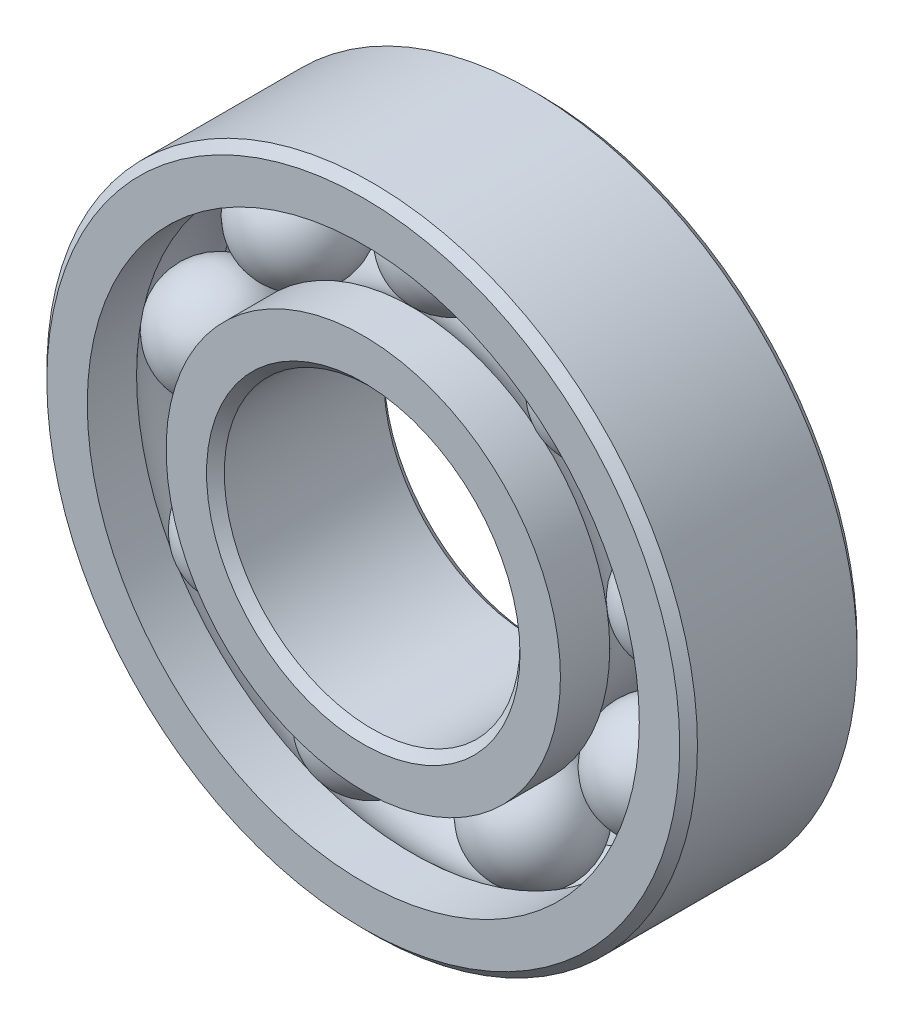
ISO-10303-21;
HEADER;
FILE_DESCRIPTION(('STEP AP214'),'2;1');
FILE_NAME('part.step','',(''),(''),'','','');
FILE_SCHEMA(('AUTOMOTIVE_DESIGN { 1 0 10303 214 1 1 1 1 }'));
ENDSEC;
DATA;
#1=APPLICATION_CONTEXT('core data for automotive mechanical design processes');
#2=APPLICATION_PROTOCOL_DEFINITION('international standard','automotive_design',2000,#1);
#3=PRODUCT_CONTEXT('',#1,'mechanical');
#4=PRODUCT('Part','Part','',(#3));
#5=PRODUCT_RELATED_PRODUCT_CATEGORY('part','',(#4));
#6=PRODUCT_DEFINITION_FORMATION('','',#4);
#7=PRODUCT_DEFINITION_CONTEXT('part definition',#1,'design');
#8=PRODUCT_DEFINITION('design','',#6,#7);
#9=PRODUCT_DEFINITION_SHAPE('','',#8);
#10=(LENGTH_UNIT() NAMED_UNIT(*) SI_UNIT(.MILLI.,.METRE.));
#11=(NAMED_UNIT(*) PLANE_ANGLE_UNIT() SI_UNIT($,.RADIAN.));
#12=(NAMED_UNIT(*) SI_UNIT($,.STERADIAN.) SOLID_ANGLE_UNIT());
#13=UNCERTAINTY_MEASURE_WITH_UNIT(LENGTH_MEASURE(1.E-05),#10,'distance_accuracy_value','');
#14=(GEOMETRIC_REPRESENTATION_CONTEXT(3) GLOBAL_UNCERTAINTY_ASSIGNED_CONTEXT((#13)) GLOBAL_UNIT_ASSIGNED_CONTEXT((#10,
#11,#12)) REPRESENTATION_CONTEXT('',''));
#15=CARTESIAN_POINT('',(0.,0.,0.));
#16=DIRECTION('',(0.,0.,1.));
#17=DIRECTION('',(1.,0.,0.));
#18=AXIS2_PLACEMENT_3D('',#15,#16,#17);
#19=CARTESIAN_POINT('',(5.14230087749224,6.12835554495189,0.));
#20=DIRECTION('',(0.,0.,1.));
#21=DIRECTION('',(0.64278760968653,0.766044443118986,0.));
#22=AXIS2_PLACEMENT_3D('',#19,#20,#21);
#23=SPHERICAL_SURFACE('',#22,1.88561808316413);
#24=CARTESIAN_POINT('',(5.14230087749224,6.12835554495189,1.88561808316413));
#25=VERTEX_POINT('',#24);
#26=VERTEX_LOOP('',#25);
#27=FACE_BOUND('',#26,.T.);
#28=ADVANCED_FACE('F41',(#27),#23,.T.);
#29=CLOSED_SHELL('',(#28));
#30=MANIFOLD_SOLID_BREP('B2',#29);
#31=CARTESIAN_POINT('',(7.87846202409765,1.38918542133552,0.));
#32=DIRECTION('',(0.,0.,1.));
#33=DIRECTION('',(0.984807753012206,0.17364817766694,0.));
#34=AXIS2_PLACEMENT_3D('',#31,#32,#33);
#35=SPHERICAL_SURFACE('',#34,1.88561808316413);
#36=CARTESIAN_POINT('',(7.87846202409765,1.38918542133552,1.88561808316413));
#37=VERTEX_POINT('',#36);
#38=VERTEX_LOOP('',#37);
#39=FACE_BOUND('',#38,.T.);
#40=ADVANCED_FACE('F61',(#39),#35,.T.);
#41=CLOSED_SHELL('',(#40));
#42=MANIFOLD_SOLID_BREP('B6',#41);
#43=CARTESIAN_POINT('',(6.92820323027555,-3.99999999999994,0.));
#44=DIRECTION('',(0.,0.,1.));
#45=DIRECTION('',(0.866025403784443,-0.499999999999992,0.));
#46=AXIS2_PLACEMENT_3D('',#43,#44,#45);
#47=SPHERICAL_SURFACE('',#46,1.88561808316413);
#48=CARTESIAN_POINT('',(6.92820323027555,-3.99999999999994,1.88561808316413));
#49=VERTEX_POINT('',#48);
#50=VERTEX_LOOP('',#49);
#51=FACE_BOUND('',#50,.T.);
#52=ADVANCED_FACE('F81',(#51),#47,.T.);
#53=CLOSED_SHELL('',(#52));
#54=MANIFOLD_SOLID_BREP('B37',#53);
#55=CARTESIAN_POINT('',(2.73616114660541,-7.51754096628725,0.));
#56=DIRECTION('',(0.,0.,1.));
#57=DIRECTION('',(0.342020143325676,-0.939692620785906,0.));
#58=AXIS2_PLACEMENT_3D('',#55,#56,#57);
#59=SPHERICAL_SURFACE('',#58,1.88561808316413);
#60=CARTESIAN_POINT('',(2.73616114660541,-7.51754096628725,1.88561808316413));
#61=VERTEX_POINT('',#60);
#62=VERTEX_LOOP('',#61);
#63=FACE_BOUND('',#62,.T.);
#64=ADVANCED_FACE('F101',(#63),#59,.T.);
#65=CLOSED_SHELL('',(#64));
#66=MANIFOLD_SOLID_BREP('B57',#65);
#67=CARTESIAN_POINT('',(-2.7361611466053,-7.51754096628729,0.));
#68=DIRECTION('',(0.,0.,1.));
#69=DIRECTION('',(-0.342020143325663,-0.939692620785911,0.));
#70=AXIS2_PLACEMENT_3D('',#67,#68,#69);
#71=SPHERICAL_SURFACE('',#70,1.88561808316413);
#72=CARTESIAN_POINT('',(-2.7361611466053,-7.51754096628729,1.88561808316413));
#73=VERTEX_POINT('',#72);
#74=VERTEX_LOOP('',#73);
#75=FACE_BOUND('',#74,.T.);
#76=ADVANCED_FACE('F121',(#75),#71,.T.);
#77=CLOSED_SHELL('',(#76));
#78=MANIFOLD_SOLID_BREP('B77',#77);
#79=CARTESIAN_POINT('',(-6.92820323027549,-4.00000000000003,0.));
#80=DIRECTION('',(0.,0.,1.));
#81=DIRECTION('',(-0.866025403784436,-0.500000000000004,0.));
#82=AXIS2_PLACEMENT_3D('',#79,#80,#81);
#83=SPHERICAL_SURFACE('',#82,1.88561808316413);
#84=CARTESIAN_POINT('',(-6.92820323027549,-4.00000000000003,1.88561808316413));
#85=VERTEX_POINT('',#84);
#86=VERTEX_LOOP('',#85);
#87=FACE_BOUND('',#86,.T.);
#88=ADVANCED_FACE('F141',(#87),#83,.T.);
#89=CLOSED_SHELL('',(#88));
#90=MANIFOLD_SOLID_BREP('B97',#89);
#91=CARTESIAN_POINT('',(-7.87846202409767,1.38918542133542,0.));
#92=DIRECTION('',(0.,0.,1.));
#93=DIRECTION('',(-0.984807753012209,0.173648177666927,0.));
#94=AXIS2_PLACEMENT_3D('',#91,#92,#93);
#95=SPHERICAL_SURFACE('',#94,1.88561808316413);
#96=CARTESIAN_POINT('',(-7.87846202409767,1.38918542133542,1.88561808316413));
#97=VERTEX_POINT('',#96);
#98=VERTEX_LOOP('',#97);
#99=FACE_BOUND('',#98,.T.);
#100=ADVANCED_FACE('F161',(#99),#95,.T.);
#101=CLOSED_SHELL('',(#100));
#102=MANIFOLD_SOLID_BREP('B117',#101);
#103=CARTESIAN_POINT('',(-5.14230087749233,6.12835554495182,0.));
#104=DIRECTION('',(0.,0.,1.));
#105=DIRECTION('',(-0.642787609686541,0.766044443118977,0.));
#106=AXIS2_PLACEMENT_3D('',#103,#104,#105);
#107=SPHERICAL_SURFACE('',#106,1.88561808316413);
#108=CARTESIAN_POINT('',(-5.14230087749233,6.12835554495182,1.88561808316413));
#109=VERTEX_POINT('',#108);
#110=VERTEX_LOOP('',#109);
#111=FACE_BOUND('',#110,.T.);
#112=ADVANCED_FACE('F181',(#111),#107,.T.);
#113=CLOSED_SHELL('',(#112));
#114=MANIFOLD_SOLID_BREP('B137',#113);
#115=CARTESIAN_POINT('',(0.,8.,0.));
#116=DIRECTION('',(0.,0.,1.));
#117=DIRECTION('',(0.,1.,0.));
#118=AXIS2_PLACEMENT_3D('',#115,#116,#117);
#119=SPHERICAL_SURFACE('',#118,1.88561808316413);
#120=CARTESIAN_POINT('',(0.,8.,1.88561808316413));
#121=VERTEX_POINT('',#120);
#122=VERTEX_LOOP('',#121);
#123=FACE_BOUND('',#122,.T.);
#124=ADVANCED_FACE('F203',(#123),#119,.T.);
#125=CLOSED_SHELL('',(#124));
#126=MANIFOLD_SOLID_BREP('B157',#125);
#127=CARTESIAN_POINT('',(0.,6.66666666666667,3.));
#128=DIRECTION('',(0.,0.,-1.));
#129=DIRECTION('',(-1.,0.,0.));
#130=AXIS2_PLACEMENT_3D('',#127,#128,#129);
#131=PLANE('',#130);
#132=CARTESIAN_POINT('',(0.,0.,3.));
#133=DIRECTION('',(0.,0.,1.));
#134=DIRECTION('',(1.,0.,0.));
#135=AXIS2_PLACEMENT_3D('',#132,#133,#134);
#136=CIRCLE('',#135,5.3);
#137=CARTESIAN_POINT('',(5.3,0.,3.));
#138=VERTEX_POINT('',#137);
#139=EDGE_CURVE('E250',#138,#138,#136,.T.);
#140=ORIENTED_EDGE('',*,*,#139,.F.);
#141=EDGE_LOOP('',(#140));
#142=FACE_BOUND('',#141,.T.);
#143=CARTESIAN_POINT('',(0.,0.,3.));
#144=DIRECTION('',(0.,0.,1.));
#145=DIRECTION('',(1.,0.,0.));
#146=AXIS2_PLACEMENT_3D('',#143,#144,#145);
#147=CIRCLE('',#146,6.66666666666667);
#148=CARTESIAN_POINT('',(6.66666666666667,0.,3.));
#149=VERTEX_POINT('',#148);
#150=EDGE_CURVE('E202',#149,#149,#147,.T.);
#151=ORIENTED_EDGE('',*,*,#150,.T.);
#152=EDGE_LOOP('',(#151));
#153=FACE_BOUND('',#152,.T.);
#154=ADVANCED_FACE('F222',(#142,#153),#131,.F.);
#155=CARTESIAN_POINT('',(0.,0.,3.));
#156=DIRECTION('',(0.,0.,1.));
#157=DIRECTION('',(1.,0.,0.));
#158=AXIS2_PLACEMENT_3D('',#155,#156,#157);
#159=CYLINDRICAL_SURFACE('',#158,6.66666666666667);
#160=ORIENTED_EDGE('',*,*,#150,.F.);
#161=EDGE_LOOP('',(#160));
#162=FACE_BOUND('',#161,.T.);
#163=CARTESIAN_POINT('',(0.,0.,1.33333333333333));
#164=DIRECTION('',(0.,0.,1.));
#165=DIRECTION('',(1.,0.,0.));
#166=AXIS2_PLACEMENT_3D('',#163,#164,#165);
#167=CIRCLE('',#166,6.66666666666667);
#168=CARTESIAN_POINT('',(6.66666666666667,0.,1.33333333333333));
#169=VERTEX_POINT('',#168);
#170=EDGE_CURVE('E228',#169,#169,#167,.T.);
#171=ORIENTED_EDGE('',*,*,#170,.T.);
#172=EDGE_LOOP('',(#171));
#173=FACE_BOUND('',#172,.T.);
#174=ADVANCED_FACE('F257',(#162,#173),#159,.T.);
#175=CARTESIAN_POINT('',(0.,0.,0.));
#176=DIRECTION('',(0.,0.,1.));
#177=DIRECTION('',(1.,0.,0.));
#178=AXIS2_PLACEMENT_3D('',#175,#176,#177);
#179=TOROIDAL_SURFACE('',#178,8.,1.88561808316413);
#180=ORIENTED_EDGE('',*,*,#170,.F.);
#181=EDGE_LOOP('',(#180));
#182=FACE_BOUND('',#181,.T.);
#183=CARTESIAN_POINT('',(0.,0.,-1.33333333333333));
#184=DIRECTION('',(0.,0.,1.));
#185=DIRECTION('',(1.,0.,0.));
#186=AXIS2_PLACEMENT_3D('',#183,#184,#185);
#187=CIRCLE('',#186,6.66666666666667);
#188=CARTESIAN_POINT('',(6.66666666666667,0.,-1.33333333333333));
#189=VERTEX_POINT('',#188);
#190=EDGE_CURVE('E232',#189,#189,#187,.T.);
#191=ORIENTED_EDGE('',*,*,#190,.T.);
#192=EDGE_LOOP('',(#191));
#193=FACE_BOUND('',#192,.T.);
#194=ADVANCED_FACE('F261',(#182,#193),#179,.F.);
#195=CARTESIAN_POINT('',(0.,0.,3.));
#196=DIRECTION('',(0.,0.,1.));
#197=DIRECTION('',(1.,0.,0.));
#198=AXIS2_PLACEMENT_3D('',#195,#196,#197);
#199=CYLINDRICAL_SURFACE('',#198,6.66666666666667);
#200=ORIENTED_EDGE('',*,*,#190,.F.);
#201=EDGE_LOOP('',(#200));
#202=FACE_BOUND('',#201,.T.);
#203=CARTESIAN_POINT('',(0.,0.,-3.));
#204=DIRECTION('',(0.,0.,1.));
#205=DIRECTION('',(1.,0.,0.));
#206=AXIS2_PLACEMENT_3D('',#203,#204,#205);
#207=CIRCLE('',#206,6.66666666666667);
#208=CARTESIAN_POINT('',(6.66666666666667,0.,-3.));
#209=VERTEX_POINT('',#208);
#210=EDGE_CURVE('E236',#209,#209,#207,.T.);
#211=ORIENTED_EDGE('',*,*,#210,.T.);
#212=EDGE_LOOP('',(#211));
#213=FACE_BOUND('',#212,.T.);
#214=ADVANCED_FACE('F266',(#202,#213),#199,.T.);
#215=CARTESIAN_POINT('',(0.,5.3,-3.));
#216=DIRECTION('',(0.,0.,1.));
#217=DIRECTION('',(1.,0.,0.));
#218=AXIS2_PLACEMENT_3D('',#215,#216,#217);
#219=PLANE('',#218);
#220=ORIENTED_EDGE('',*,*,#210,.F.);
#221=EDGE_LOOP('',(#220));
#222=FACE_BOUND('',#221,.T.);
#223=CARTESIAN_POINT('',(0.,0.,-3.));
#224=DIRECTION('',(0.,0.,1.));
#225=DIRECTION('',(1.,0.,0.));
#226=AXIS2_PLACEMENT_3D('',#223,#224,#225);
#227=CIRCLE('',#226,5.3);
#228=CARTESIAN_POINT('',(5.3,0.,-3.));
#229=VERTEX_POINT('',#228);
#230=EDGE_CURVE('E241',#229,#229,#227,.T.);
#231=ORIENTED_EDGE('',*,*,#230,.T.);
#232=EDGE_LOOP('',(#231));
#233=FACE_BOUND('',#232,.T.);
#234=ADVANCED_FACE('F272',(#222,#233),#219,.F.);
#235=CARTESIAN_POINT('',(0.,0.,-2.7));
#236=DIRECTION('',(0.,0.,-1.));
#237=DIRECTION('',(-1.,0.,0.));
#238=AXIS2_PLACEMENT_3D('',#235,#236,#237);
#239=CONICAL_SURFACE('',#238,5.,0.78539816339745);
#240=ORIENTED_EDGE('',*,*,#230,.F.);
#241=EDGE_LOOP('',(#240));
#242=FACE_BOUND('',#241,.T.);
#243=CARTESIAN_POINT('',(0.,0.,-2.7));
#244=DIRECTION('',(0.,0.,1.));
#245=DIRECTION('',(1.,0.,0.));
#246=AXIS2_PLACEMENT_3D('',#243,#244,#245);
#247=CIRCLE('',#246,5.);
#248=CARTESIAN_POINT('',(5.,0.,-2.7));
#249=VERTEX_POINT('',#248);
#250=EDGE_CURVE('E244',#249,#249,#247,.T.);
#251=ORIENTED_EDGE('',*,*,#250,.T.);
#252=EDGE_LOOP('',(#251));
#253=FACE_BOUND('',#252,.T.);
#254=ADVANCED_FACE('F276',(#242,#253),#239,.F.);
#255=CARTESIAN_POINT('',(0.,0.,3.));
#256=DIRECTION('',(0.,0.,1.));
#257=DIRECTION('',(1.,0.,0.));
#258=AXIS2_PLACEMENT_3D('',#255,#256,#257);
#259=CYLINDRICAL_SURFACE('',#258,5.);
#260=ORIENTED_EDGE('',*,*,#250,.F.);
#261=EDGE_LOOP('',(#260));
#262=FACE_BOUND('',#261,.T.);
#263=CARTESIAN_POINT('',(0.,0.,2.7));
#264=DIRECTION('',(0.,0.,1.));
#265=DIRECTION('',(1.,0.,0.));
#266=AXIS2_PLACEMENT_3D('',#263,#264,#265);
#267=CIRCLE('',#266,5.);
#268=CARTESIAN_POINT('',(5.,0.,2.7));
#269=VERTEX_POINT('',#268);
#270=EDGE_CURVE('E247',#269,#269,#267,.T.);
#271=ORIENTED_EDGE('',*,*,#270,.T.);
#272=EDGE_LOOP('',(#271));
#273=FACE_BOUND('',#272,.T.);
#274=ADVANCED_FACE('F280',(#262,#273),#259,.F.);
#275=CARTESIAN_POINT('',(0.,0.,3.));
#276=DIRECTION('',(0.,0.,1.));
#277=DIRECTION('',(1.,0.,0.));
#278=AXIS2_PLACEMENT_3D('',#275,#276,#277);
#279=CONICAL_SURFACE('',#278,5.3,0.785398163397445);
#280=ORIENTED_EDGE('',*,*,#270,.F.);
#281=EDGE_LOOP('',(#280));
#282=FACE_BOUND('',#281,.T.);
#283=ORIENTED_EDGE('',*,*,#139,.T.);
#284=EDGE_LOOP('',(#283));
#285=FACE_BOUND('',#284,.T.);
#286=ADVANCED_FACE('F254',(#282,#285),#279,.F.);
#287=CLOSED_SHELL('',(#154,#174,#194,#214,#234,#254,#274,#286));
#288=MANIFOLD_SOLID_BREP('B177',#287);
#289=CARTESIAN_POINT('',(0.,0.,2.7));
#290=DIRECTION('',(0.,0.,-1.));
#291=DIRECTION('',(-1.,0.,0.));
#292=AXIS2_PLACEMENT_3D('',#289,#290,#291);
#293=CONICAL_SURFACE('',#292,11.,0.785398163397446);
#294=CARTESIAN_POINT('',(0.,0.,3.));
#295=DIRECTION('',(0.,0.,1.));
#296=DIRECTION('',(1.,0.,0.));
#297=AXIS2_PLACEMENT_3D('',#294,#295,#296);
#298=CIRCLE('',#297,10.7);
#299=CARTESIAN_POINT('',(10.7,0.,3.));
#300=VERTEX_POINT('',#299);
#301=EDGE_CURVE('E371',#300,#300,#298,.T.);
#302=ORIENTED_EDGE('',*,*,#301,.F.);
#303=EDGE_LOOP('',(#302));
#304=FACE_BOUND('',#303,.T.);
#305=CARTESIAN_POINT('',(0.,0.,2.7));
#306=DIRECTION('',(0.,0.,1.));
#307=DIRECTION('',(1.,0.,0.));
#308=AXIS2_PLACEMENT_3D('',#305,#306,#307);
#309=CIRCLE('',#308,11.);
#310=CARTESIAN_POINT('',(11.,0.,2.7));
#311=VERTEX_POINT('',#310);
#312=EDGE_CURVE('E221',#311,#311,#309,.T.);
#313=ORIENTED_EDGE('',*,*,#312,.T.);
#314=EDGE_LOOP('',(#313));
#315=FACE_BOUND('',#314,.T.);
#316=ADVANCED_FACE('F343',(#304,#315),#293,.T.);
#317=CARTESIAN_POINT('',(0.,0.,3.));
#318=DIRECTION('',(0.,0.,1.));
#319=DIRECTION('',(1.,0.,0.));
#320=AXIS2_PLACEMENT_3D('',#317,#318,#319);
#321=CYLINDRICAL_SURFACE('',#320,11.);
#322=ORIENTED_EDGE('',*,*,#312,.F.);
#323=EDGE_LOOP('',(#322));
#324=FACE_BOUND('',#323,.T.);
#325=CARTESIAN_POINT('',(0.,0.,-2.7));
#326=DIRECTION('',(0.,0.,1.));
#327=DIRECTION('',(1.,0.,0.));
#328=AXIS2_PLACEMENT_3D('',#325,#326,#327);
#329=CIRCLE('',#328,11.);
#330=CARTESIAN_POINT('',(11.,0.,-2.7));
#331=VERTEX_POINT('',#330);
#332=EDGE_CURVE('E349',#331,#331,#329,.T.);
#333=ORIENTED_EDGE('',*,*,#332,.T.);
#334=EDGE_LOOP('',(#333));
#335=FACE_BOUND('',#334,.T.);
#336=ADVANCED_FACE('F378',(#324,#335),#321,.T.);
#337=CARTESIAN_POINT('',(0.,0.,-3.));
#338=DIRECTION('',(0.,0.,1.));
#339=DIRECTION('',(1.,0.,0.));
#340=AXIS2_PLACEMENT_3D('',#337,#338,#339);
#341=CONICAL_SURFACE('',#340,10.7,0.785398163397447);
#342=ORIENTED_EDGE('',*,*,#332,.F.);
#343=EDGE_LOOP('',(#342));
#344=FACE_BOUND('',#343,.T.);
#345=CARTESIAN_POINT('',(0.,0.,-3.));
#346=DIRECTION('',(0.,0.,1.));
#347=DIRECTION('',(1.,0.,0.));
#348=AXIS2_PLACEMENT_3D('',#345,#346,#347);
#349=CIRCLE('',#348,10.7);
#350=CARTESIAN_POINT('',(10.7,0.,-3.));
#351=VERTEX_POINT('',#350);
#352=EDGE_CURVE('E353',#351,#351,#349,.T.);
#353=ORIENTED_EDGE('',*,*,#352,.T.);
#354=EDGE_LOOP('',(#353));
#355=FACE_BOUND('',#354,.T.);
#356=ADVANCED_FACE('F382',(#344,#355),#341,.T.);
#357=CARTESIAN_POINT('',(0.,10.7,-3.));
#358=DIRECTION('',(0.,0.,1.));
#359=DIRECTION('',(1.,0.,0.));
#360=AXIS2_PLACEMENT_3D('',#357,#358,#359);
#361=PLANE('',#360);
#362=ORIENTED_EDGE('',*,*,#352,.F.);
#363=EDGE_LOOP('',(#362));
#364=FACE_BOUND('',#363,.T.);
#365=CARTESIAN_POINT('',(0.,0.,-3.));
#366=DIRECTION('',(0.,0.,1.));
#367=DIRECTION('',(1.,0.,0.));
#368=AXIS2_PLACEMENT_3D('',#365,#366,#367);
#369=CIRCLE('',#368,9.33333333333333);
#370=CARTESIAN_POINT('',(9.33333333333333,0.,-3.));
#371=VERTEX_POINT('',#370);
#372=EDGE_CURVE('E357',#371,#371,#369,.T.);
#373=ORIENTED_EDGE('',*,*,#372,.T.);
#374=EDGE_LOOP('',(#373));
#375=FACE_BOUND('',#374,.T.);
#376=ADVANCED_FACE('F387',(#364,#375),#361,.F.);
#377=CARTESIAN_POINT('',(0.,0.,3.));
#378=DIRECTION('',(0.,0.,1.));
#379=DIRECTION('',(1.,0.,0.));
#380=AXIS2_PLACEMENT_3D('',#377,#378,#379);
#381=CYLINDRICAL_SURFACE('',#380,9.33333333333333);
#382=ORIENTED_EDGE('',*,*,#372,.F.);
#383=EDGE_LOOP('',(#382));
#384=FACE_BOUND('',#383,.T.);
#385=CARTESIAN_POINT('',(0.,0.,-1.33333333333333));
#386=DIRECTION('',(0.,0.,1.));
#387=DIRECTION('',(1.,0.,0.));
#388=AXIS2_PLACEMENT_3D('',#385,#386,#387);
#389=CIRCLE('',#388,9.33333333333333);
#390=CARTESIAN_POINT('',(9.33333333333333,0.,-1.33333333333333));
#391=VERTEX_POINT('',#390);
#392=EDGE_CURVE('E362',#391,#391,#389,.T.);
#393=ORIENTED_EDGE('',*,*,#392,.T.);
#394=EDGE_LOOP('',(#393));
#395=FACE_BOUND('',#394,.T.);
#396=ADVANCED_FACE('F393',(#384,#395),#381,.F.);
#397=CARTESIAN_POINT('',(0.,0.,0.));
#398=DIRECTION('',(0.,0.,1.));
#399=DIRECTION('',(1.,0.,0.));
#400=AXIS2_PLACEMENT_3D('',#397,#398,#399);
#401=TOROIDAL_SURFACE('',#400,8.,1.88561808316413);
#402=ORIENTED_EDGE('',*,*,#392,.F.);
#403=EDGE_LOOP('',(#402));
#404=FACE_BOUND('',#403,.T.);
#405=CARTESIAN_POINT('',(0.,0.,1.33333333333333));
#406=DIRECTION('',(0.,0.,1.));
#407=DIRECTION('',(1.,0.,0.));
#408=AXIS2_PLACEMENT_3D('',#405,#406,#407);
#409=CIRCLE('',#408,9.33333333333333);
#410=CARTESIAN_POINT('',(9.33333333333333,0.,1.33333333333333));
#411=VERTEX_POINT('',#410);
#412=EDGE_CURVE('E365',#411,#411,#409,.T.);
#413=ORIENTED_EDGE('',*,*,#412,.T.);
#414=EDGE_LOOP('',(#413));
#415=FACE_BOUND('',#414,.T.);
#416=ADVANCED_FACE('F397',(#404,#415),#401,.F.);
#417=CARTESIAN_POINT('',(0.,0.,3.));
#418=DIRECTION('',(0.,0.,1.));
#419=DIRECTION('',(1.,0.,0.));
#420=AXIS2_PLACEMENT_3D('',#417,#418,#419);
#421=CYLINDRICAL_SURFACE('',#420,9.33333333333333);
#422=ORIENTED_EDGE('',*,*,#412,.F.);
#423=EDGE_LOOP('',(#422));
#424=FACE_BOUND('',#423,.T.);
#425=CARTESIAN_POINT('',(0.,0.,3.));
#426=DIRECTION('',(0.,0.,1.));
#427=DIRECTION('',(1.,0.,0.));
#428=AXIS2_PLACEMENT_3D('',#425,#426,#427);
#429=CIRCLE('',#428,9.33333333333333);
#430=CARTESIAN_POINT('',(9.33333333333333,0.,3.));
#431=VERTEX_POINT('',#430);
#432=EDGE_CURVE('E368',#431,#431,#429,.T.);
#433=ORIENTED_EDGE('',*,*,#432,.T.);
#434=EDGE_LOOP('',(#433));
#435=FACE_BOUND('',#434,.T.);
#436=ADVANCED_FACE('F401',(#424,#435),#421,.F.);
#437=CARTESIAN_POINT('',(0.,10.7,3.));
#438=DIRECTION('',(0.,0.,-1.));
#439=DIRECTION('',(-1.,0.,0.));
#440=AXIS2_PLACEMENT_3D('',#437,#438,#439);
#441=PLANE('',#440);
#442=ORIENTED_EDGE('',*,*,#432,.F.);
#443=EDGE_LOOP('',(#442));
#444=FACE_BOUND('',#443,.T.);
#445=ORIENTED_EDGE('',*,*,#301,.T.);
#446=EDGE_LOOP('',(#445));
#447=FACE_BOUND('',#446,.T.);
#448=ADVANCED_FACE('F375',(#444,#447),#441,.F.);
#449=CLOSED_SHELL('',(#316,#336,#356,#376,#396,#416,#436,#448));
#450=MANIFOLD_SOLID_BREP('B197',#449);
#451=ADVANCED_BREP_SHAPE_REPRESENTATION('',(#18,#30,#42,#54,#66,#78,#90,#102,#114,#126,#288,
#450),#14);
#452=SHAPE_DEFINITION_REPRESENTATION(#9,#451);
ENDSEC;
END-ISO-10303-21;
